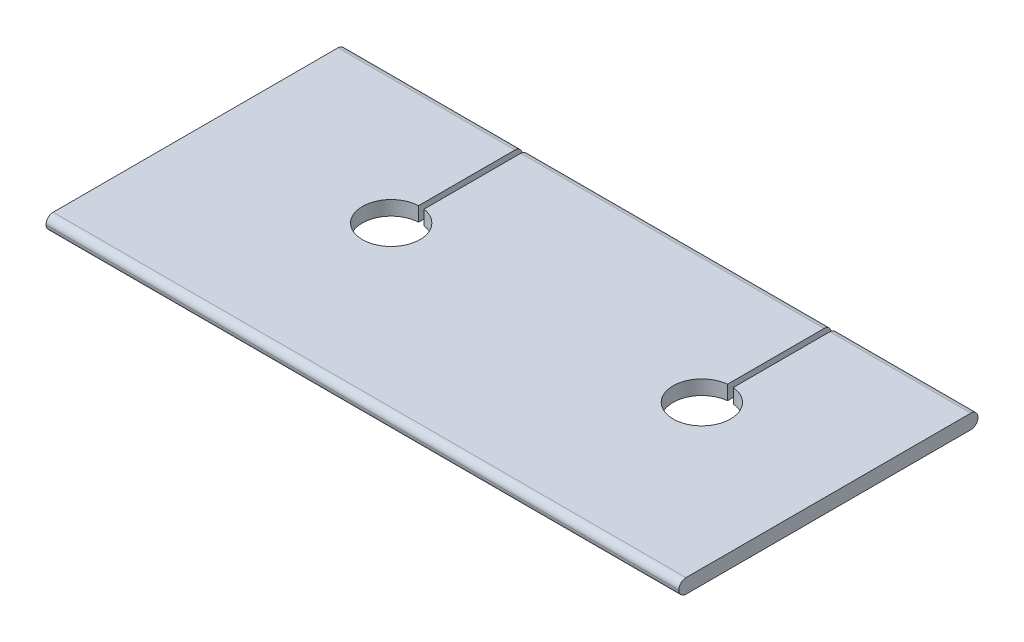
ISO-10303-21;
HEADER;
FILE_DESCRIPTION(('STEP AP214'),'2;1');
FILE_NAME('part.step','',(''),(''),'','','');
FILE_SCHEMA(('AUTOMOTIVE_DESIGN { 1 0 10303 214 1 1 1 1 }'));
ENDSEC;
DATA;
#1=APPLICATION_CONTEXT('core data for automotive mechanical design processes');
#2=APPLICATION_PROTOCOL_DEFINITION('international standard','automotive_design',2000,#1);
#3=PRODUCT_CONTEXT('',#1,'mechanical');
#4=PRODUCT('Part','Part','',(#3));
#5=PRODUCT_RELATED_PRODUCT_CATEGORY('part','',(#4));
#6=PRODUCT_DEFINITION_FORMATION('','',#4);
#7=PRODUCT_DEFINITION_CONTEXT('part definition',#1,'design');
#8=PRODUCT_DEFINITION('design','',#6,#7);
#9=PRODUCT_DEFINITION_SHAPE('','',#8);
#10=(LENGTH_UNIT() NAMED_UNIT(*) SI_UNIT(.MILLI.,.METRE.));
#11=(NAMED_UNIT(*) PLANE_ANGLE_UNIT() SI_UNIT($,.RADIAN.));
#12=(NAMED_UNIT(*) SI_UNIT($,.STERADIAN.) SOLID_ANGLE_UNIT());
#13=UNCERTAINTY_MEASURE_WITH_UNIT(LENGTH_MEASURE(1.E-05),#10,'distance_accuracy_value','');
#14=(GEOMETRIC_REPRESENTATION_CONTEXT(3) GLOBAL_UNCERTAINTY_ASSIGNED_CONTEXT((#13)) GLOBAL_UNIT_ASSIGNED_CONTEXT((#10,
#11,#12)) REPRESENTATION_CONTEXT('',''));
#15=CARTESIAN_POINT('',(0.,0.,0.));
#16=DIRECTION('',(0.,0.,1.));
#17=DIRECTION('',(1.,0.,0.));
#18=AXIS2_PLACEMENT_3D('',#15,#16,#17);
#19=CARTESIAN_POINT('',(55.,0.625000000000002,-12.38));
#20=DIRECTION('',(0.,-1.,0.));
#21=DIRECTION('',(0.,0.,-1.));
#22=AXIS2_PLACEMENT_3D('',#19,#20,#21);
#23=PLANE('',#22);
#24=DIRECTION('',(0.,0.,-1.));
#25=VECTOR('',#24,1.);
#26=CARTESIAN_POINT('',(42.2463087653029,0.625000000000001,0.));
#27=LINE('',#26,#25);
#28=CARTESIAN_POINT('',(42.2463087653029,0.625000000000001,-3.98709484287145));
#29=VERTEX_POINT('',#28);
#30=CARTESIAN_POINT('',(42.2463087653029,0.625000000000002,-12.38));
#31=VERTEX_POINT('',#30);
#32=EDGE_CURVE('E178',#29,#31,#27,.T.);
#33=ORIENTED_EDGE('',*,*,#32,.T.);
#34=DIRECTION('',(-1.,0.,0.));
#35=VECTOR('',#34,1.);
#36=CARTESIAN_POINT('',(55.,0.625000000000002,-12.38));
#37=LINE('',#36,#35);
#38=CARTESIAN_POINT('',(15.8822562967505,0.625000000000002,-12.38));
#39=VERTEX_POINT('',#38);
#40=EDGE_CURVE('E305',#31,#39,#37,.T.);
#41=ORIENTED_EDGE('',*,*,#40,.T.);
#42=DIRECTION('',(0.,0.,-1.));
#43=VECTOR('',#42,1.);
#44=CARTESIAN_POINT('',(15.8822562967505,0.625000000000001,0.));
#45=LINE('',#44,#43);
#46=CARTESIAN_POINT('',(15.8822562967505,0.625000000000001,-3.97060319023402));
#47=VERTEX_POINT('',#46);
#48=EDGE_CURVE('E217',#47,#39,#45,.T.);
#49=ORIENTED_EDGE('',*,*,#48,.F.);
#50=CARTESIAN_POINT('',(15.5,0.625000000000001,-1.49999999999998));
#51=DIRECTION('',(0.,1.,0.));
#52=DIRECTION('',(0.,0.,1.));
#53=AXIS2_PLACEMENT_3D('',#50,#51,#52);
#54=CIRCLE('',#53,2.5);
#55=CARTESIAN_POINT('',(15.3822562967505,0.625000000000001,-3.99722574477058));
#56=VERTEX_POINT('',#55);
#57=EDGE_CURVE('E224',#56,#47,#54,.T.);
#58=ORIENTED_EDGE('',*,*,#57,.F.);
#59=DIRECTION('',(0.,0.,-1.));
#60=VECTOR('',#59,1.);
#61=CARTESIAN_POINT('',(15.3822562967505,0.625000000000001,0.));
#62=LINE('',#61,#60);
#63=CARTESIAN_POINT('',(15.3822562967505,0.625000000000002,-12.38));
#64=VERTEX_POINT('',#63);
#65=EDGE_CURVE('E213',#56,#64,#62,.T.);
#66=ORIENTED_EDGE('',*,*,#65,.T.);
#67=CARTESIAN_POINT('',(0.,0.625000000000002,-12.38));
#68=VERTEX_POINT('',#67);
#69=EDGE_CURVE('E300',#64,#68,#37,.T.);
#70=ORIENTED_EDGE('',*,*,#69,.T.);
#71=DIRECTION('',(0.,0.,1.));
#72=VECTOR('',#71,1.);
#73=CARTESIAN_POINT('',(0.,0.625000000000002,-12.38));
#74=LINE('',#73,#72);
#75=CARTESIAN_POINT('',(0.,0.624999999999999,12.38));
#76=VERTEX_POINT('',#75);
#77=EDGE_CURVE('E275',#68,#76,#74,.T.);
#78=ORIENTED_EDGE('',*,*,#77,.T.);
#79=DIRECTION('',(-1.,0.,0.));
#80=VECTOR('',#79,1.);
#81=CARTESIAN_POINT('',(55.,0.624999999999999,12.38));
#82=LINE('',#81,#80);
#83=CARTESIAN_POINT('',(55.,0.624999999999999,12.38));
#84=VERTEX_POINT('',#83);
#85=EDGE_CURVE('E297',#84,#76,#82,.T.);
#86=ORIENTED_EDGE('',*,*,#85,.F.);
#87=DIRECTION('',(0.,0.,1.));
#88=VECTOR('',#87,1.);
#89=CARTESIAN_POINT('',(55.,0.625000000000002,-12.38));
#90=LINE('',#89,#88);
#91=CARTESIAN_POINT('',(55.,0.625000000000002,-12.38));
#92=VERTEX_POINT('',#91);
#93=EDGE_CURVE('E256',#92,#84,#90,.T.);
#94=ORIENTED_EDGE('',*,*,#93,.F.);
#95=CARTESIAN_POINT('',(42.7463087653029,0.625000000000002,-12.38));
#96=VERTEX_POINT('',#95);
#97=EDGE_CURVE('E301',#92,#96,#37,.T.);
#98=ORIENTED_EDGE('',*,*,#97,.T.);
#99=DIRECTION('',(0.,0.,-1.));
#100=VECTOR('',#99,1.);
#101=CARTESIAN_POINT('',(42.7463087653029,0.625000000000001,0.));
#102=LINE('',#101,#100);
#103=CARTESIAN_POINT('',(42.7463087653029,0.625000000000001,-3.98783680978774));
#104=VERTEX_POINT('',#103);
#105=EDGE_CURVE('E50',#104,#96,#102,.T.);
#106=ORIENTED_EDGE('',*,*,#105,.F.);
#107=CARTESIAN_POINT('',(42.5,0.625000000000001,-1.49999999999998));
#108=DIRECTION('',(0.,1.,0.));
#109=DIRECTION('',(0.,0.,1.));
#110=AXIS2_PLACEMENT_3D('',#107,#108,#109);
#111=CIRCLE('',#110,2.5);
#112=EDGE_CURVE('E196',#29,#104,#111,.T.);
#113=ORIENTED_EDGE('',*,*,#112,.F.);
#114=EDGE_LOOP('',(#33,#41,#49,#58,#66,#70,#78,#86,#94,#98,#106,#113));
#115=FACE_BOUND('',#114,.T.);
#116=ADVANCED_FACE('F35',(#115),#23,.F.);
#117=CARTESIAN_POINT('',(55.,-0.624999999999999,-12.38));
#118=DIRECTION('',(0.,1.,0.));
#119=DIRECTION('',(0.,0.,1.));
#120=AXIS2_PLACEMENT_3D('',#117,#118,#119);
#121=PLANE('',#120);
#122=DIRECTION('',(0.,0.,-1.));
#123=VECTOR('',#122,1.);
#124=CARTESIAN_POINT('',(42.2463087653029,-0.625000000000003,0.));
#125=LINE('',#124,#123);
#126=CARTESIAN_POINT('',(42.2463087653029,-0.625000000000003,-3.98709484287145));
#127=VERTEX_POINT('',#126);
#128=CARTESIAN_POINT('',(42.2463087653029,-0.625000000000002,-12.38));
#129=VERTEX_POINT('',#128);
#130=EDGE_CURVE('E175',#127,#129,#125,.T.);
#131=ORIENTED_EDGE('',*,*,#130,.F.);
#132=CARTESIAN_POINT('',(42.5,-0.625000000000003,-1.49999999999998));
#133=DIRECTION('',(0.,1.,0.));
#134=DIRECTION('',(0.,0.,1.));
#135=AXIS2_PLACEMENT_3D('',#132,#133,#134);
#136=CIRCLE('',#135,2.5);
#137=CARTESIAN_POINT('',(42.7463087653029,-0.625000000000003,-3.98783680978774));
#138=VERTEX_POINT('',#137);
#139=EDGE_CURVE('E186',#127,#138,#136,.T.);
#140=ORIENTED_EDGE('',*,*,#139,.T.);
#141=DIRECTION('',(0.,0.,-1.));
#142=VECTOR('',#141,1.);
#143=CARTESIAN_POINT('',(42.7463087653029,-0.625000000000003,0.));
#144=LINE('',#143,#142);
#145=CARTESIAN_POINT('',(42.7463087653029,-0.625000000000002,-12.38));
#146=VERTEX_POINT('',#145);
#147=EDGE_CURVE('E183',#138,#146,#144,.T.);
#148=ORIENTED_EDGE('',*,*,#147,.T.);
#149=DIRECTION('',(-1.,0.,0.));
#150=VECTOR('',#149,1.);
#151=CARTESIAN_POINT('',(55.,-0.624999999999999,-12.38));
#152=LINE('',#151,#150);
#153=CARTESIAN_POINT('',(55.,-0.624999999999999,-12.38));
#154=VERTEX_POINT('',#153);
#155=EDGE_CURVE('E285',#154,#146,#152,.T.);
#156=ORIENTED_EDGE('',*,*,#155,.F.);
#157=DIRECTION('',(0.,0.,-1.));
#158=VECTOR('',#157,1.);
#159=CARTESIAN_POINT('',(55.,-0.624999999999999,-12.38));
#160=LINE('',#159,#158);
#161=CARTESIAN_POINT('',(55.,-0.625000000000002,12.38));
#162=VERTEX_POINT('',#161);
#163=EDGE_CURVE('E264',#162,#154,#160,.T.);
#164=ORIENTED_EDGE('',*,*,#163,.F.);
#165=DIRECTION('',(-1.,0.,0.));
#166=VECTOR('',#165,1.);
#167=CARTESIAN_POINT('',(55.,-0.625000000000002,12.38));
#168=LINE('',#167,#166);
#169=CARTESIAN_POINT('',(0.,-0.625000000000002,12.38));
#170=VERTEX_POINT('',#169);
#171=EDGE_CURVE('E288',#162,#170,#168,.T.);
#172=ORIENTED_EDGE('',*,*,#171,.T.);
#173=DIRECTION('',(0.,0.,-1.));
#174=VECTOR('',#173,1.);
#175=CARTESIAN_POINT('',(0.,-0.624999999999999,-12.38));
#176=LINE('',#175,#174);
#177=CARTESIAN_POINT('',(0.,-0.624999999999999,-12.38));
#178=VERTEX_POINT('',#177);
#179=EDGE_CURVE('E252',#170,#178,#176,.T.);
#180=ORIENTED_EDGE('',*,*,#179,.T.);
#181=CARTESIAN_POINT('',(15.3822562967505,-0.625000000000002,-12.38));
#182=VERTEX_POINT('',#181);
#183=EDGE_CURVE('E266',#182,#178,#152,.T.);
#184=ORIENTED_EDGE('',*,*,#183,.F.);
#185=DIRECTION('',(0.,0.,-1.));
#186=VECTOR('',#185,1.);
#187=CARTESIAN_POINT('',(15.3822562967505,-0.625000000000003,0.));
#188=LINE('',#187,#186);
#189=CARTESIAN_POINT('',(15.3822562967505,-0.625000000000003,-3.99722574477058));
#190=VERTEX_POINT('',#189);
#191=EDGE_CURVE('E214',#190,#182,#188,.T.);
#192=ORIENTED_EDGE('',*,*,#191,.F.);
#193=CARTESIAN_POINT('',(15.5,-0.625000000000003,-1.49999999999998));
#194=DIRECTION('',(0.,1.,0.));
#195=DIRECTION('',(0.,0.,1.));
#196=AXIS2_PLACEMENT_3D('',#193,#194,#195);
#197=CIRCLE('',#196,2.5);
#198=CARTESIAN_POINT('',(15.8822562967505,-0.625,-3.97060319023402));
#199=VERTEX_POINT('',#198);
#200=EDGE_CURVE('E216',#190,#199,#197,.T.);
#201=ORIENTED_EDGE('',*,*,#200,.T.);
#202=DIRECTION('',(0.,0.,-1.));
#203=VECTOR('',#202,1.);
#204=CARTESIAN_POINT('',(15.8822562967505,-0.625000000000003,0.));
#205=LINE('',#204,#203);
#206=CARTESIAN_POINT('',(15.8822562967505,-0.625000000000002,-12.38));
#207=VERTEX_POINT('',#206);
#208=EDGE_CURVE('E58',#199,#207,#205,.T.);
#209=ORIENTED_EDGE('',*,*,#208,.T.);
#210=EDGE_CURVE('E194',#129,#207,#152,.T.);
#211=ORIENTED_EDGE('',*,*,#210,.F.);
#212=EDGE_LOOP('',(#131,#140,#148,#156,#164,#172,#180,#184,#192,#201,#209,#211));
#213=FACE_BOUND('',#212,.T.);
#214=ADVANCED_FACE('F193',(#213),#121,.F.);
#215=CARTESIAN_POINT('',(55.,-0.00499999999999893,-12.38));
#216=DIRECTION('',(-1.,0.,0.));
#217=DIRECTION('',(0.,0.,1.));
#218=AXIS2_PLACEMENT_3D('',#215,#216,#217);
#219=CYLINDRICAL_SURFACE('',#218,0.62);
#220=CARTESIAN_POINT('',(42.2463087653029,-0.00499999999999893,-12.38));
#221=DIRECTION('',(1.,0.,0.));
#222=DIRECTION('',(0.,0.,-1.));
#223=AXIS2_PLACEMENT_3D('',#220,#221,#222);
#224=CIRCLE('',#223,0.62);
#225=CARTESIAN_POINT('',(42.2463087653029,-0.00499999999999459,-13.));
#226=VERTEX_POINT('',#225);
#227=EDGE_CURVE('E211',#129,#226,#224,.T.);
#228=ORIENTED_EDGE('',*,*,#227,.F.);
#229=ORIENTED_EDGE('',*,*,#210,.T.);
#230=CARTESIAN_POINT('',(15.8822562967505,-0.00499999999999893,-12.38));
#231=DIRECTION('',(1.,0.,0.));
#232=DIRECTION('',(0.,0.,-1.));
#233=AXIS2_PLACEMENT_3D('',#230,#231,#232);
#234=CIRCLE('',#233,0.62);
#235=CARTESIAN_POINT('',(15.8822562967505,-0.00499999999999459,-13.));
#236=VERTEX_POINT('',#235);
#237=EDGE_CURVE('E238',#207,#236,#234,.T.);
#238=ORIENTED_EDGE('',*,*,#237,.T.);
#239=DIRECTION('',(-1.,0.,0.));
#240=VECTOR('',#239,1.);
#241=CARTESIAN_POINT('',(55.,-0.00499999999999459,-13.));
#242=LINE('',#241,#240);
#243=EDGE_CURVE('E313',#226,#236,#242,.T.);
#244=ORIENTED_EDGE('',*,*,#243,.F.);
#245=EDGE_LOOP('',(#228,#229,#238,#244));
#246=FACE_BOUND('',#245,.T.);
#247=ADVANCED_FACE('F375',(#246),#219,.T.);
#248=CARTESIAN_POINT('',(55.,0.00499999999999784,-13.));
#249=DIRECTION('',(0.,0.,1.));
#250=DIRECTION('',(1.,0.,0.));
#251=AXIS2_PLACEMENT_3D('',#248,#249,#250);
#252=PLANE('',#251);
#253=DIRECTION('',(0.,1.,0.));
#254=VECTOR('',#253,1.);
#255=CARTESIAN_POINT('',(42.2463087653029,0.00499999999999784,-13.));
#256=LINE('',#255,#254);
#257=CARTESIAN_POINT('',(42.2463087653029,0.00500000000000218,-13.));
#258=VERTEX_POINT('',#257);
#259=EDGE_CURVE('E209',#226,#258,#256,.T.);
#260=ORIENTED_EDGE('',*,*,#259,.F.);
#261=ORIENTED_EDGE('',*,*,#243,.T.);
#262=DIRECTION('',(0.,1.,0.));
#263=VECTOR('',#262,1.);
#264=CARTESIAN_POINT('',(15.8822562967505,0.00499999999999784,-13.));
#265=LINE('',#264,#263);
#266=CARTESIAN_POINT('',(15.8822562967505,0.00500000000000218,-13.));
#267=VERTEX_POINT('',#266);
#268=EDGE_CURVE('E235',#236,#267,#265,.T.);
#269=ORIENTED_EDGE('',*,*,#268,.T.);
#270=DIRECTION('',(-1.,0.,0.));
#271=VECTOR('',#270,1.);
#272=CARTESIAN_POINT('',(55.,0.00499999999999784,-13.));
#273=LINE('',#272,#271);
#274=EDGE_CURVE('E310',#258,#267,#273,.T.);
#275=ORIENTED_EDGE('',*,*,#274,.F.);
#276=EDGE_LOOP('',(#260,#261,#269,#275));
#277=FACE_BOUND('',#276,.T.);
#278=ADVANCED_FACE('F384',(#277),#252,.F.);
#279=CARTESIAN_POINT('',(55.,0.00500000000000218,-12.38));
#280=DIRECTION('',(-1.,0.,0.));
#281=DIRECTION('',(0.,0.,1.));
#282=AXIS2_PLACEMENT_3D('',#279,#280,#281);
#283=CYLINDRICAL_SURFACE('',#282,0.619999999999999);
#284=CARTESIAN_POINT('',(42.2463087653029,0.00500000000000218,-12.38));
#285=DIRECTION('',(1.,0.,0.));
#286=DIRECTION('',(0.,0.,-1.));
#287=AXIS2_PLACEMENT_3D('',#284,#285,#286);
#288=CIRCLE('',#287,0.619999999999999);
#289=EDGE_CURVE('E11',#258,#31,#288,.T.);
#290=ORIENTED_EDGE('',*,*,#289,.F.);
#291=ORIENTED_EDGE('',*,*,#274,.T.);
#292=CARTESIAN_POINT('',(15.8822562967505,0.00500000000000218,-12.38));
#293=DIRECTION('',(1.,0.,0.));
#294=DIRECTION('',(0.,0.,-1.));
#295=AXIS2_PLACEMENT_3D('',#292,#293,#294);
#296=CIRCLE('',#295,0.619999999999999);
#297=EDGE_CURVE('E231',#267,#39,#296,.T.);
#298=ORIENTED_EDGE('',*,*,#297,.T.);
#299=ORIENTED_EDGE('',*,*,#40,.F.);
#300=EDGE_LOOP('',(#290,#291,#298,#299));
#301=FACE_BOUND('',#300,.T.);
#302=ADVANCED_FACE('F338',(#301),#283,.T.);
#303=CARTESIAN_POINT('',(15.3822562967505,-0.00499999999999893,-12.38));
#304=DIRECTION('',(1.,0.,0.));
#305=DIRECTION('',(0.,0.,-1.));
#306=AXIS2_PLACEMENT_3D('',#303,#304,#305);
#307=CIRCLE('',#306,0.62);
#308=CARTESIAN_POINT('',(15.3822562967505,-0.00499999999999459,-13.));
#309=VERTEX_POINT('',#308);
#310=EDGE_CURVE('E245',#182,#309,#307,.T.);
#311=ORIENTED_EDGE('',*,*,#310,.F.);
#312=ORIENTED_EDGE('',*,*,#183,.T.);
#313=CARTESIAN_POINT('',(0.,-0.00499999999999893,-12.38));
#314=DIRECTION('',(1.,0.,0.));
#315=DIRECTION('',(0.,0.,1.));
#316=AXIS2_PLACEMENT_3D('',#313,#314,#315);
#317=CIRCLE('',#316,0.62);
#318=CARTESIAN_POINT('',(0.,-0.00499999999999459,-13.));
#319=VERTEX_POINT('',#318);
#320=EDGE_CURVE('E247',#178,#319,#317,.T.);
#321=ORIENTED_EDGE('',*,*,#320,.T.);
#322=EDGE_CURVE('E309',#309,#319,#242,.T.);
#323=ORIENTED_EDGE('',*,*,#322,.F.);
#324=EDGE_LOOP('',(#311,#312,#321,#323));
#325=FACE_BOUND('',#324,.T.);
#326=ADVANCED_FACE('F372',(#325),#219,.T.);
#327=DIRECTION('',(0.,1.,0.));
#328=VECTOR('',#327,1.);
#329=CARTESIAN_POINT('',(15.3822562967505,0.00499999999999784,-13.));
#330=LINE('',#329,#328);
#331=CARTESIAN_POINT('',(15.3822562967505,0.00500000000000218,-13.));
#332=VERTEX_POINT('',#331);
#333=EDGE_CURVE('E243',#309,#332,#330,.T.);
#334=ORIENTED_EDGE('',*,*,#333,.F.);
#335=ORIENTED_EDGE('',*,*,#322,.T.);
#336=DIRECTION('',(0.,1.,0.));
#337=VECTOR('',#336,1.);
#338=CARTESIAN_POINT('',(0.,0.00499999999999784,-13.));
#339=LINE('',#338,#337);
#340=CARTESIAN_POINT('',(0.,0.00499999999999784,-13.));
#341=VERTEX_POINT('',#340);
#342=EDGE_CURVE('E269',#319,#341,#339,.T.);
#343=ORIENTED_EDGE('',*,*,#342,.T.);
#344=EDGE_CURVE('E304',#332,#341,#273,.T.);
#345=ORIENTED_EDGE('',*,*,#344,.F.);
#346=EDGE_LOOP('',(#334,#335,#343,#345));
#347=FACE_BOUND('',#346,.T.);
#348=ADVANCED_FACE('F387',(#347),#252,.F.);
#349=CARTESIAN_POINT('',(15.3822562967505,0.00500000000000218,-12.38));
#350=DIRECTION('',(1.,0.,0.));
#351=DIRECTION('',(0.,0.,-1.));
#352=AXIS2_PLACEMENT_3D('',#349,#350,#351);
#353=CIRCLE('',#352,0.619999999999999);
#354=EDGE_CURVE('E241',#332,#64,#353,.T.);
#355=ORIENTED_EDGE('',*,*,#354,.F.);
#356=ORIENTED_EDGE('',*,*,#344,.T.);
#357=CARTESIAN_POINT('',(0.,0.00500000000000218,-12.38));
#358=DIRECTION('',(1.,0.,0.));
#359=DIRECTION('',(0.,0.,1.));
#360=AXIS2_PLACEMENT_3D('',#357,#358,#359);
#361=CIRCLE('',#360,0.619999999999999);
#362=EDGE_CURVE('E272',#341,#68,#361,.T.);
#363=ORIENTED_EDGE('',*,*,#362,.T.);
#364=ORIENTED_EDGE('',*,*,#69,.F.);
#365=EDGE_LOOP('',(#355,#356,#363,#364));
#366=FACE_BOUND('',#365,.T.);
#367=ADVANCED_FACE('F348',(#366),#283,.T.);
#368=ORIENTED_EDGE('',*,*,#155,.T.);
#369=CARTESIAN_POINT('',(42.7463087653029,-0.00499999999999893,-12.38));
#370=DIRECTION('',(1.,0.,0.));
#371=DIRECTION('',(0.,0.,-1.));
#372=AXIS2_PLACEMENT_3D('',#369,#370,#371);
#373=CIRCLE('',#372,0.62);
#374=CARTESIAN_POINT('',(42.7463087653029,-0.00499999999999459,-13.));
#375=VERTEX_POINT('',#374);
#376=EDGE_CURVE('E206',#146,#375,#373,.T.);
#377=ORIENTED_EDGE('',*,*,#376,.T.);
#378=CARTESIAN_POINT('',(55.,-0.00499999999999459,-13.));
#379=VERTEX_POINT('',#378);
#380=EDGE_CURVE('E311',#379,#375,#242,.T.);
#381=ORIENTED_EDGE('',*,*,#380,.F.);
#382=CARTESIAN_POINT('',(55.,-0.00499999999999893,-12.38));
#383=DIRECTION('',(1.,0.,0.));
#384=DIRECTION('',(0.,0.,1.));
#385=AXIS2_PLACEMENT_3D('',#382,#383,#384);
#386=CIRCLE('',#385,0.62);
#387=EDGE_CURVE('E248',#154,#379,#386,.T.);
#388=ORIENTED_EDGE('',*,*,#387,.F.);
#389=EDGE_LOOP('',(#368,#377,#381,#388));
#390=FACE_BOUND('',#389,.T.);
#391=ADVANCED_FACE('F37',(#390),#219,.T.);
#392=ORIENTED_EDGE('',*,*,#380,.T.);
#393=DIRECTION('',(0.,1.,0.));
#394=VECTOR('',#393,1.);
#395=CARTESIAN_POINT('',(42.7463087653029,0.00499999999999784,-13.));
#396=LINE('',#395,#394);
#397=CARTESIAN_POINT('',(42.7463087653029,0.00500000000000218,-13.));
#398=VERTEX_POINT('',#397);
#399=EDGE_CURVE('E202',#375,#398,#396,.T.);
#400=ORIENTED_EDGE('',*,*,#399,.T.);
#401=CARTESIAN_POINT('',(55.,0.00499999999999784,-13.));
#402=VERTEX_POINT('',#401);
#403=EDGE_CURVE('E306',#402,#398,#273,.T.);
#404=ORIENTED_EDGE('',*,*,#403,.F.);
#405=DIRECTION('',(0.,1.,0.));
#406=VECTOR('',#405,1.);
#407=CARTESIAN_POINT('',(55.,0.00499999999999784,-13.));
#408=LINE('',#407,#406);
#409=EDGE_CURVE('E251',#379,#402,#408,.T.);
#410=ORIENTED_EDGE('',*,*,#409,.F.);
#411=EDGE_LOOP('',(#392,#400,#404,#410));
#412=FACE_BOUND('',#411,.T.);
#413=ADVANCED_FACE('F329',(#412),#252,.F.);
#414=ORIENTED_EDGE('',*,*,#403,.T.);
#415=CARTESIAN_POINT('',(42.7463087653029,0.00500000000000218,-12.38));
#416=DIRECTION('',(1.,0.,0.));
#417=DIRECTION('',(0.,0.,-1.));
#418=AXIS2_PLACEMENT_3D('',#415,#416,#417);
#419=CIRCLE('',#418,0.619999999999999);
#420=EDGE_CURVE('E43',#398,#96,#419,.T.);
#421=ORIENTED_EDGE('',*,*,#420,.T.);
#422=ORIENTED_EDGE('',*,*,#97,.F.);
#423=CARTESIAN_POINT('',(55.,0.00500000000000218,-12.38));
#424=DIRECTION('',(1.,0.,0.));
#425=DIRECTION('',(0.,0.,1.));
#426=AXIS2_PLACEMENT_3D('',#423,#424,#425);
#427=CIRCLE('',#426,0.619999999999999);
#428=EDGE_CURVE('E254',#402,#92,#427,.T.);
#429=ORIENTED_EDGE('',*,*,#428,.F.);
#430=EDGE_LOOP('',(#414,#421,#422,#429));
#431=FACE_BOUND('',#430,.T.);
#432=ADVANCED_FACE('F316',(#431),#283,.T.);
#433=CARTESIAN_POINT('',(55.,0.00499999999999893,12.38));
#434=DIRECTION('',(-1.,0.,0.));
#435=DIRECTION('',(0.,0.,1.));
#436=AXIS2_PLACEMENT_3D('',#433,#434,#435);
#437=CYLINDRICAL_SURFACE('',#436,0.62);
#438=CARTESIAN_POINT('',(0.,0.00499999999999893,12.38));
#439=DIRECTION('',(1.,0.,0.));
#440=DIRECTION('',(0.,0.,-1.));
#441=AXIS2_PLACEMENT_3D('',#438,#439,#440);
#442=CIRCLE('',#441,0.62);
#443=CARTESIAN_POINT('',(0.,0.00499999999999295,13.));
#444=VERTEX_POINT('',#443);
#445=EDGE_CURVE('E277',#76,#444,#442,.T.);
#446=ORIENTED_EDGE('',*,*,#445,.T.);
#447=DIRECTION('',(-1.,0.,0.));
#448=VECTOR('',#447,1.);
#449=CARTESIAN_POINT('',(55.,0.00499999999999295,13.));
#450=LINE('',#449,#448);
#451=CARTESIAN_POINT('',(55.,0.00499999999999295,13.));
#452=VERTEX_POINT('',#451);
#453=EDGE_CURVE('E294',#452,#444,#450,.T.);
#454=ORIENTED_EDGE('',*,*,#453,.F.);
#455=CARTESIAN_POINT('',(55.,0.00499999999999893,12.38));
#456=DIRECTION('',(1.,0.,0.));
#457=DIRECTION('',(0.,0.,-1.));
#458=AXIS2_PLACEMENT_3D('',#455,#456,#457);
#459=CIRCLE('',#458,0.62);
#460=EDGE_CURVE('E258',#84,#452,#459,.T.);
#461=ORIENTED_EDGE('',*,*,#460,.F.);
#462=ORIENTED_EDGE('',*,*,#85,.T.);
#463=EDGE_LOOP('',(#446,#454,#461,#462));
#464=FACE_BOUND('',#463,.T.);
#465=ADVANCED_FACE('F358',(#464),#437,.T.);
#466=CARTESIAN_POINT('',(55.,0.00499999999999275,13.));
#467=DIRECTION('',(0.,0.,-1.));
#468=DIRECTION('',(-1.,0.,0.));
#469=AXIS2_PLACEMENT_3D('',#466,#467,#468);
#470=PLANE('',#469);
#471=DIRECTION('',(0.,-1.,0.));
#472=VECTOR('',#471,1.);
#473=CARTESIAN_POINT('',(0.,0.00499999999999275,13.));
#474=LINE('',#473,#472);
#475=CARTESIAN_POINT('',(0.,-0.00499999999999871,13.));
#476=VERTEX_POINT('',#475);
#477=EDGE_CURVE('E279',#444,#476,#474,.T.);
#478=ORIENTED_EDGE('',*,*,#477,.T.);
#479=DIRECTION('',(-1.,0.,0.));
#480=VECTOR('',#479,1.);
#481=CARTESIAN_POINT('',(55.,-0.00499999999999871,13.));
#482=LINE('',#481,#480);
#483=CARTESIAN_POINT('',(55.,-0.00499999999999871,13.));
#484=VERTEX_POINT('',#483);
#485=EDGE_CURVE('E291',#484,#476,#482,.T.);
#486=ORIENTED_EDGE('',*,*,#485,.F.);
#487=DIRECTION('',(0.,-1.,0.));
#488=VECTOR('',#487,1.);
#489=CARTESIAN_POINT('',(55.,0.00499999999999275,13.));
#490=LINE('',#489,#488);
#491=EDGE_CURVE('E260',#452,#484,#490,.T.);
#492=ORIENTED_EDGE('',*,*,#491,.F.);
#493=ORIENTED_EDGE('',*,*,#453,.T.);
#494=EDGE_LOOP('',(#478,#486,#492,#493));
#495=FACE_BOUND('',#494,.T.);
#496=ADVANCED_FACE('F361',(#495),#470,.F.);
#497=CARTESIAN_POINT('',(55.,-0.00500000000000229,12.38));
#498=DIRECTION('',(-1.,0.,0.));
#499=DIRECTION('',(0.,0.,1.));
#500=AXIS2_PLACEMENT_3D('',#497,#498,#499);
#501=CYLINDRICAL_SURFACE('',#500,0.619999999999999);
#502=CARTESIAN_POINT('',(0.,-0.00500000000000229,12.38));
#503=DIRECTION('',(1.,0.,0.));
#504=DIRECTION('',(0.,0.,1.));
#505=AXIS2_PLACEMENT_3D('',#502,#503,#504);
#506=CIRCLE('',#505,0.619999999999999);
#507=EDGE_CURVE('E281',#476,#170,#506,.T.);
#508=ORIENTED_EDGE('',*,*,#507,.T.);
#509=ORIENTED_EDGE('',*,*,#171,.F.);
#510=CARTESIAN_POINT('',(55.,-0.00500000000000229,12.38));
#511=DIRECTION('',(1.,0.,0.));
#512=DIRECTION('',(0.,0.,1.));
#513=AXIS2_PLACEMENT_3D('',#510,#511,#512);
#514=CIRCLE('',#513,0.619999999999999);
#515=EDGE_CURVE('E262',#484,#162,#514,.T.);
#516=ORIENTED_EDGE('',*,*,#515,.F.);
#517=ORIENTED_EDGE('',*,*,#485,.T.);
#518=EDGE_LOOP('',(#508,#509,#516,#517));
#519=FACE_BOUND('',#518,.T.);
#520=ADVANCED_FACE('F366',(#519),#501,.T.);
#521=CARTESIAN_POINT('',(55.,-0.00499999999999893,-12.38));
#522=DIRECTION('',(-1.,0.,0.));
#523=DIRECTION('',(0.,0.,1.));
#524=AXIS2_PLACEMENT_3D('',#521,#522,#523);
#525=PLANE('',#524);
#526=ORIENTED_EDGE('',*,*,#387,.T.);
#527=ORIENTED_EDGE('',*,*,#409,.T.);
#528=ORIENTED_EDGE('',*,*,#428,.T.);
#529=ORIENTED_EDGE('',*,*,#93,.T.);
#530=ORIENTED_EDGE('',*,*,#460,.T.);
#531=ORIENTED_EDGE('',*,*,#491,.T.);
#532=ORIENTED_EDGE('',*,*,#515,.T.);
#533=ORIENTED_EDGE('',*,*,#163,.T.);
#534=EDGE_LOOP('',(#526,#527,#528,#529,#530,#531,#532,#533));
#535=FACE_BOUND('',#534,.T.);
#536=ADVANCED_FACE('F324',(#535),#525,.F.);
#537=CARTESIAN_POINT('',(0.,-0.00499999999999893,-12.38));
#538=DIRECTION('',(-1.,0.,0.));
#539=DIRECTION('',(0.,0.,1.));
#540=AXIS2_PLACEMENT_3D('',#537,#538,#539);
#541=PLANE('',#540);
#542=ORIENTED_EDGE('',*,*,#320,.F.);
#543=ORIENTED_EDGE('',*,*,#179,.F.);
#544=ORIENTED_EDGE('',*,*,#507,.F.);
#545=ORIENTED_EDGE('',*,*,#477,.F.);
#546=ORIENTED_EDGE('',*,*,#445,.F.);
#547=ORIENTED_EDGE('',*,*,#77,.F.);
#548=ORIENTED_EDGE('',*,*,#362,.F.);
#549=ORIENTED_EDGE('',*,*,#342,.F.);
#550=EDGE_LOOP('',(#542,#543,#544,#545,#546,#547,#548,#549));
#551=FACE_BOUND('',#550,.T.);
#552=ADVANCED_FACE('F354',(#551),#541,.T.);
#553=CARTESIAN_POINT('',(15.3822562967505,-0.625000000000003,0.));
#554=DIRECTION('',(1.,0.,0.));
#555=DIRECTION('',(0.,0.,-1.));
#556=AXIS2_PLACEMENT_3D('',#553,#554,#555);
#557=PLANE('',#556);
#558=ORIENTED_EDGE('',*,*,#310,.T.);
#559=ORIENTED_EDGE('',*,*,#333,.T.);
#560=ORIENTED_EDGE('',*,*,#354,.T.);
#561=ORIENTED_EDGE('',*,*,#65,.F.);
#562=DIRECTION('',(0.,1.,0.));
#563=VECTOR('',#562,1.);
#564=CARTESIAN_POINT('',(15.3822562967505,-0.625000000000003,-3.99722574477058));
#565=LINE('',#564,#563);
#566=EDGE_CURVE('E221',#190,#56,#565,.T.);
#567=ORIENTED_EDGE('',*,*,#566,.F.);
#568=ORIENTED_EDGE('',*,*,#191,.T.);
#569=EDGE_LOOP('',(#558,#559,#560,#561,#567,#568));
#570=FACE_BOUND('',#569,.T.);
#571=ADVANCED_FACE('F389',(#570),#557,.T.);
#572=CARTESIAN_POINT('',(15.8822562967505,-0.625000000000003,0.));
#573=DIRECTION('',(1.,0.,0.));
#574=DIRECTION('',(0.,0.,-1.));
#575=AXIS2_PLACEMENT_3D('',#572,#573,#574);
#576=PLANE('',#575);
#577=ORIENTED_EDGE('',*,*,#208,.F.);
#578=DIRECTION('',(0.,1.,0.));
#579=VECTOR('',#578,1.);
#580=CARTESIAN_POINT('',(15.8822562967505,-0.625000000000003,-3.97060319023402));
#581=LINE('',#580,#579);
#582=EDGE_CURVE('E229',#199,#47,#581,.T.);
#583=ORIENTED_EDGE('',*,*,#582,.T.);
#584=ORIENTED_EDGE('',*,*,#48,.T.);
#585=ORIENTED_EDGE('',*,*,#297,.F.);
#586=ORIENTED_EDGE('',*,*,#268,.F.);
#587=ORIENTED_EDGE('',*,*,#237,.F.);
#588=EDGE_LOOP('',(#577,#583,#584,#585,#586,#587));
#589=FACE_BOUND('',#588,.T.);
#590=ADVANCED_FACE('F378',(#589),#576,.F.);
#591=CARTESIAN_POINT('',(15.5,-0.625000000000003,-1.49999999999998));
#592=DIRECTION('',(0.,1.,0.));
#593=DIRECTION('',(0.,0.,1.));
#594=AXIS2_PLACEMENT_3D('',#591,#592,#593);
#595=CYLINDRICAL_SURFACE('',#594,2.5);
#596=ORIENTED_EDGE('',*,*,#57,.T.);
#597=ORIENTED_EDGE('',*,*,#582,.F.);
#598=ORIENTED_EDGE('',*,*,#200,.F.);
#599=ORIENTED_EDGE('',*,*,#566,.T.);
#600=EDGE_LOOP('',(#596,#597,#598,#599));
#601=FACE_BOUND('',#600,.T.);
#602=ADVANCED_FACE('F381',(#601),#595,.F.);
#603=CARTESIAN_POINT('',(42.2463087653029,-0.625000000000003,0.));
#604=DIRECTION('',(1.,0.,0.));
#605=DIRECTION('',(0.,0.,-1.));
#606=AXIS2_PLACEMENT_3D('',#603,#604,#605);
#607=PLANE('',#606);
#608=ORIENTED_EDGE('',*,*,#227,.T.);
#609=ORIENTED_EDGE('',*,*,#259,.T.);
#610=ORIENTED_EDGE('',*,*,#289,.T.);
#611=ORIENTED_EDGE('',*,*,#32,.F.);
#612=DIRECTION('',(0.,1.,0.));
#613=VECTOR('',#612,1.);
#614=CARTESIAN_POINT('',(42.2463087653029,-0.625000000000003,-3.98709484287145));
#615=LINE('',#614,#613);
#616=EDGE_CURVE('E171',#127,#29,#615,.T.);
#617=ORIENTED_EDGE('',*,*,#616,.F.);
#618=ORIENTED_EDGE('',*,*,#130,.T.);
#619=EDGE_LOOP('',(#608,#609,#610,#611,#617,#618));
#620=FACE_BOUND('',#619,.T.);
#621=ADVANCED_FACE('F173',(#620),#607,.T.);
#622=CARTESIAN_POINT('',(42.7463087653029,-0.625000000000003,0.));
#623=DIRECTION('',(1.,0.,0.));
#624=DIRECTION('',(0.,0.,-1.));
#625=AXIS2_PLACEMENT_3D('',#622,#623,#624);
#626=PLANE('',#625);
#627=ORIENTED_EDGE('',*,*,#147,.F.);
#628=DIRECTION('',(0.,1.,0.));
#629=VECTOR('',#628,1.);
#630=CARTESIAN_POINT('',(42.7463087653029,-0.625000000000003,-3.98783680978774));
#631=LINE('',#630,#629);
#632=EDGE_CURVE('E182',#138,#104,#631,.T.);
#633=ORIENTED_EDGE('',*,*,#632,.T.);
#634=ORIENTED_EDGE('',*,*,#105,.T.);
#635=ORIENTED_EDGE('',*,*,#420,.F.);
#636=ORIENTED_EDGE('',*,*,#399,.F.);
#637=ORIENTED_EDGE('',*,*,#376,.F.);
#638=EDGE_LOOP('',(#627,#633,#634,#635,#636,#637));
#639=FACE_BOUND('',#638,.T.);
#640=ADVANCED_FACE('F330',(#639),#626,.F.);
#641=CARTESIAN_POINT('',(42.5,-0.625000000000003,-1.49999999999998));
#642=DIRECTION('',(0.,1.,0.));
#643=DIRECTION('',(0.,0.,1.));
#644=AXIS2_PLACEMENT_3D('',#641,#642,#643);
#645=CYLINDRICAL_SURFACE('',#644,2.5);
#646=ORIENTED_EDGE('',*,*,#112,.T.);
#647=ORIENTED_EDGE('',*,*,#632,.F.);
#648=ORIENTED_EDGE('',*,*,#139,.F.);
#649=ORIENTED_EDGE('',*,*,#616,.T.);
#650=EDGE_LOOP('',(#646,#647,#648,#649));
#651=FACE_BOUND('',#650,.T.);
#652=ADVANCED_FACE('F187',(#651),#645,.F.);
#653=CLOSED_SHELL('',(#116,#214,#247,#278,#302,#326,#348,#367,#391,#413,#432,#465,#496,#520,
#536,#552,#571,#590,#602,#621,#640,#652));
#654=MANIFOLD_SOLID_BREP('B2',#653);
#655=ADVANCED_BREP_SHAPE_REPRESENTATION('',(#18,#654),#14);
#656=SHAPE_DEFINITION_REPRESENTATION(#9,#655);
ENDSEC;
END-ISO-10303-21;
